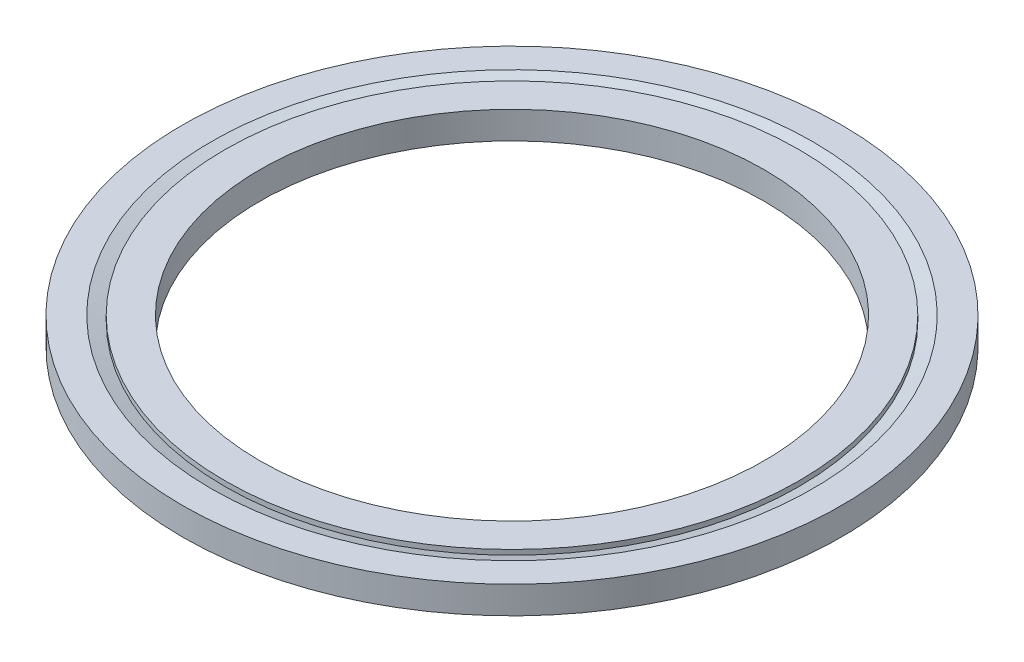
ISO-10303-21;
HEADER;
FILE_DESCRIPTION(('STEP AP214'),'2;1');
FILE_NAME('part.step','',(''),(''),'','','');
FILE_SCHEMA(('AUTOMOTIVE_DESIGN { 1 0 10303 214 1 1 1 1 }'));
ENDSEC;
DATA;
#1=APPLICATION_CONTEXT('core data for automotive mechanical design processes');
#2=APPLICATION_PROTOCOL_DEFINITION('international standard','automotive_design',2000,#1);
#3=PRODUCT_CONTEXT('',#1,'mechanical');
#4=PRODUCT('Part','Part','',(#3));
#5=PRODUCT_RELATED_PRODUCT_CATEGORY('part','',(#4));
#6=PRODUCT_DEFINITION_FORMATION('','',#4);
#7=PRODUCT_DEFINITION_CONTEXT('part definition',#1,'design');
#8=PRODUCT_DEFINITION('design','',#6,#7);
#9=PRODUCT_DEFINITION_SHAPE('','',#8);
#10=(LENGTH_UNIT() NAMED_UNIT(*) SI_UNIT(.MILLI.,.METRE.));
#11=(NAMED_UNIT(*) PLANE_ANGLE_UNIT() SI_UNIT($,.RADIAN.));
#12=(NAMED_UNIT(*) SI_UNIT($,.STERADIAN.) SOLID_ANGLE_UNIT());
#13=UNCERTAINTY_MEASURE_WITH_UNIT(LENGTH_MEASURE(1.E-05),#10,'distance_accuracy_value','');
#14=(GEOMETRIC_REPRESENTATION_CONTEXT(3) GLOBAL_UNCERTAINTY_ASSIGNED_CONTEXT((#13)) GLOBAL_UNIT_ASSIGNED_CONTEXT((#10,
#11,#12)) REPRESENTATION_CONTEXT('',''));
#15=CARTESIAN_POINT('',(0.,0.,0.));
#16=DIRECTION('',(0.,0.,1.));
#17=DIRECTION('',(1.,0.,0.));
#18=AXIS2_PLACEMENT_3D('',#15,#16,#17);
#19=CARTESIAN_POINT('',(0.,-0.999998,0.));
#20=DIRECTION('',(0.,1.,0.));
#21=DIRECTION('',(0.,0.,1.));
#22=AXIS2_PLACEMENT_3D('',#19,#20,#21);
#23=PLANE('',#22);
#24=CARTESIAN_POINT('',(0.,-0.999998,0.));
#25=DIRECTION('',(0.,1.,0.));
#26=DIRECTION('',(0.,0.,1.));
#27=AXIS2_PLACEMENT_3D('',#24,#25,#26);
#28=CIRCLE('',#27,24.0665);
#29=CARTESIAN_POINT('',(0.,-0.999998,24.0665));
#30=VERTEX_POINT('',#29);
#31=EDGE_CURVE('E10',#30,#30,#28,.T.);
#32=ORIENTED_EDGE('',*,*,#31,.F.);
#33=EDGE_LOOP('',(#32));
#34=FACE_BOUND('',#33,.T.);
#35=CARTESIAN_POINT('',(0.,-0.999998,0.));
#36=DIRECTION('',(0.,1.,0.));
#37=DIRECTION('',(0.,0.,1.));
#38=AXIS2_PLACEMENT_3D('',#35,#36,#37);
#39=CIRCLE('',#38,21.957823763146);
#40=CARTESIAN_POINT('',(0.,-0.999998,21.957823763146));
#41=VERTEX_POINT('',#40);
#42=EDGE_CURVE('E61',#41,#41,#39,.F.);
#43=ORIENTED_EDGE('',*,*,#42,.F.);
#44=EDGE_LOOP('',(#43));
#45=FACE_BOUND('',#44,.T.);
#46=ADVANCED_FACE('F39',(#34,#45),#23,.F.);
#47=CARTESIAN_POINT('',(0.,0.999998,0.));
#48=DIRECTION('',(0.,-1.,0.));
#49=DIRECTION('',(0.,0.,-1.));
#50=AXIS2_PLACEMENT_3D('',#47,#48,#49);
#51=PLANE('',#50);
#52=CARTESIAN_POINT('',(0.,0.999998,0.));
#53=DIRECTION('',(0.,1.,0.));
#54=DIRECTION('',(0.,0.,1.));
#55=AXIS2_PLACEMENT_3D('',#52,#53,#54);
#56=CIRCLE('',#55,24.0665);
#57=CARTESIAN_POINT('',(0.,0.999998,24.0665));
#58=VERTEX_POINT('',#57);
#59=EDGE_CURVE('E47',#58,#58,#56,.T.);
#60=ORIENTED_EDGE('',*,*,#59,.T.);
#61=EDGE_LOOP('',(#60));
#62=FACE_BOUND('',#61,.T.);
#63=CARTESIAN_POINT('',(0.,0.999998,0.));
#64=DIRECTION('',(0.,-1.,0.));
#65=DIRECTION('',(0.,0.,-1.));
#66=AXIS2_PLACEMENT_3D('',#63,#64,#65);
#67=CIRCLE('',#66,21.957823763146);
#68=CARTESIAN_POINT('',(0.,0.999998,-21.957823763146));
#69=VERTEX_POINT('',#68);
#70=EDGE_CURVE('E52',#69,#69,#67,.F.);
#71=ORIENTED_EDGE('',*,*,#70,.F.);
#72=EDGE_LOOP('',(#71));
#73=FACE_BOUND('',#72,.T.);
#74=ADVANCED_FACE('F93',(#62,#73),#51,.F.);
#75=CARTESIAN_POINT('',(0.,0.999998,0.));
#76=DIRECTION('',(0.,1.,0.));
#77=DIRECTION('',(0.,0.,1.));
#78=AXIS2_PLACEMENT_3D('',#75,#76,#77);
#79=CYLINDRICAL_SURFACE('',#78,24.0665);
#80=ORIENTED_EDGE('',*,*,#59,.F.);
#81=EDGE_LOOP('',(#80));
#82=FACE_BOUND('',#81,.T.);
#83=ORIENTED_EDGE('',*,*,#31,.T.);
#84=EDGE_LOOP('',(#83));
#85=FACE_BOUND('',#84,.T.);
#86=ADVANCED_FACE('F102',(#82,#85),#79,.T.);
#87=CARTESIAN_POINT('',(0.,1.79985033774564,0.));
#88=DIRECTION('',(0.,1.,0.));
#89=DIRECTION('',(0.,0.,1.));
#90=AXIS2_PLACEMENT_3D('',#87,#88,#89);
#91=CONICAL_SURFACE('',#90,24.1554,1.221730476396);
#92=CARTESIAN_POINT('',(0.,0.635,0.));
#93=DIRECTION('',(0.,-1.,0.));
#94=DIRECTION('',(0.,0.,-1.));
#95=AXIS2_PLACEMENT_3D('',#92,#93,#94);
#96=CIRCLE('',#95,20.955);
#97=CARTESIAN_POINT('',(0.,0.635,-20.955));
#98=VERTEX_POINT('',#97);
#99=EDGE_CURVE('E59',#98,#98,#96,.T.);
#100=ORIENTED_EDGE('',*,*,#99,.T.);
#101=EDGE_LOOP('',(#100));
#102=FACE_BOUND('',#101,.T.);
#103=ORIENTED_EDGE('',*,*,#70,.T.);
#104=EDGE_LOOP('',(#103));
#105=FACE_BOUND('',#104,.T.);
#106=ADVANCED_FACE('F79',(#102,#105),#91,.F.);
#107=CARTESIAN_POINT('',(0.,0.,0.));
#108=DIRECTION('',(0.,-1.,0.));
#109=DIRECTION('',(0.,0.,-1.));
#110=AXIS2_PLACEMENT_3D('',#107,#108,#109);
#111=CYLINDRICAL_SURFACE('',#110,20.955);
#112=ORIENTED_EDGE('',*,*,#99,.F.);
#113=EDGE_LOOP('',(#112));
#114=FACE_BOUND('',#113,.T.);
#115=CARTESIAN_POINT('',(0.,0.999998,0.));
#116=DIRECTION('',(0.,-1.,0.));
#117=DIRECTION('',(0.,0.,-1.));
#118=AXIS2_PLACEMENT_3D('',#115,#116,#117);
#119=CIRCLE('',#118,20.955);
#120=CARTESIAN_POINT('',(0.,0.999998,-20.955));
#121=VERTEX_POINT('',#120);
#122=EDGE_CURVE('E56',#121,#121,#119,.T.);
#123=ORIENTED_EDGE('',*,*,#122,.T.);
#124=EDGE_LOOP('',(#123));
#125=FACE_BOUND('',#124,.T.);
#126=ADVANCED_FACE('F82',(#114,#125),#111,.T.);
#127=CARTESIAN_POINT('',(0.,0.999998,0.));
#128=DIRECTION('',(0.,1.,0.));
#129=DIRECTION('',(0.,0.,1.));
#130=AXIS2_PLACEMENT_3D('',#127,#128,#129);
#131=CIRCLE('',#130,18.415);
#132=CARTESIAN_POINT('',(0.,0.999998,18.415));
#133=VERTEX_POINT('',#132);
#134=EDGE_CURVE('E73',#133,#133,#131,.T.);
#135=ORIENTED_EDGE('',*,*,#134,.F.);
#136=EDGE_LOOP('',(#135));
#137=FACE_BOUND('',#136,.T.);
#138=ORIENTED_EDGE('',*,*,#122,.F.);
#139=EDGE_LOOP('',(#138));
#140=FACE_BOUND('',#139,.T.);
#141=ADVANCED_FACE('F85',(#137,#140),#51,.F.);
#142=CARTESIAN_POINT('',(0.,0.,0.));
#143=DIRECTION('',(0.,-1.,0.));
#144=DIRECTION('',(0.,0.,-1.));
#145=AXIS2_PLACEMENT_3D('',#142,#143,#144);
#146=CYLINDRICAL_SURFACE('',#145,20.955);
#147=CARTESIAN_POINT('',(0.,-0.635000000000005,0.));
#148=DIRECTION('',(0.,-1.,0.));
#149=DIRECTION('',(0.,0.,-1.));
#150=AXIS2_PLACEMENT_3D('',#147,#148,#149);
#151=CIRCLE('',#150,20.955);
#152=CARTESIAN_POINT('',(0.,-0.635000000000005,-20.955));
#153=VERTEX_POINT('',#152);
#154=EDGE_CURVE('E63',#153,#153,#151,.T.);
#155=ORIENTED_EDGE('',*,*,#154,.T.);
#156=EDGE_LOOP('',(#155));
#157=FACE_BOUND('',#156,.T.);
#158=CARTESIAN_POINT('',(0.,-0.999998,0.));
#159=DIRECTION('',(0.,1.,0.));
#160=DIRECTION('',(0.,0.,1.));
#161=AXIS2_PLACEMENT_3D('',#158,#159,#160);
#162=CIRCLE('',#161,20.955);
#163=CARTESIAN_POINT('',(0.,-0.999998,20.955));
#164=VERTEX_POINT('',#163);
#165=EDGE_CURVE('E43',#164,#164,#162,.T.);
#166=ORIENTED_EDGE('',*,*,#165,.T.);
#167=EDGE_LOOP('',(#166));
#168=FACE_BOUND('',#167,.T.);
#169=ADVANCED_FACE('F90',(#157,#168),#146,.T.);
#170=CARTESIAN_POINT('',(0.,-0.635000000000005,0.));
#171=DIRECTION('',(0.,-1.,0.));
#172=DIRECTION('',(0.,0.,-1.));
#173=AXIS2_PLACEMENT_3D('',#170,#171,#172);
#174=CONICAL_SURFACE('',#173,20.955,1.221730476396);
#175=ORIENTED_EDGE('',*,*,#154,.F.);
#176=EDGE_LOOP('',(#175));
#177=FACE_BOUND('',#176,.T.);
#178=ORIENTED_EDGE('',*,*,#42,.T.);
#179=EDGE_LOOP('',(#178));
#180=FACE_BOUND('',#179,.T.);
#181=ADVANCED_FACE('F97',(#177,#180),#174,.F.);
#182=CARTESIAN_POINT('',(0.,-0.999998,0.));
#183=DIRECTION('',(0.,1.,0.));
#184=DIRECTION('',(0.,0.,1.));
#185=AXIS2_PLACEMENT_3D('',#182,#183,#184);
#186=CIRCLE('',#185,18.415);
#187=CARTESIAN_POINT('',(0.,-0.999998,18.415));
#188=VERTEX_POINT('',#187);
#189=EDGE_CURVE('E68',#188,#188,#186,.T.);
#190=ORIENTED_EDGE('',*,*,#189,.T.);
#191=EDGE_LOOP('',(#190));
#192=FACE_BOUND('',#191,.T.);
#193=ORIENTED_EDGE('',*,*,#165,.F.);
#194=EDGE_LOOP('',(#193));
#195=FACE_BOUND('',#194,.T.);
#196=ADVANCED_FACE('F41',(#192,#195),#23,.F.);
#197=CARTESIAN_POINT('',(0.,-0.999998,0.));
#198=DIRECTION('',(0.,1.,0.));
#199=DIRECTION('',(0.,0.,1.));
#200=AXIS2_PLACEMENT_3D('',#197,#198,#199);
#201=CYLINDRICAL_SURFACE('',#200,18.415);
#202=ORIENTED_EDGE('',*,*,#189,.F.);
#203=EDGE_LOOP('',(#202));
#204=FACE_BOUND('',#203,.T.);
#205=ORIENTED_EDGE('',*,*,#134,.T.);
#206=EDGE_LOOP('',(#205));
#207=FACE_BOUND('',#206,.T.);
#208=ADVANCED_FACE('F110',(#204,#207),#201,.F.);
#209=CLOSED_SHELL('',(#46,#74,#86,#106,#126,#141,#169,#181,#196,#208));
#210=MANIFOLD_SOLID_BREP('B2',#209);
#211=ADVANCED_BREP_SHAPE_REPRESENTATION('',(#18,#210),#14);
#212=SHAPE_DEFINITION_REPRESENTATION(#9,#211);
ENDSEC;
END-ISO-10303-21;
